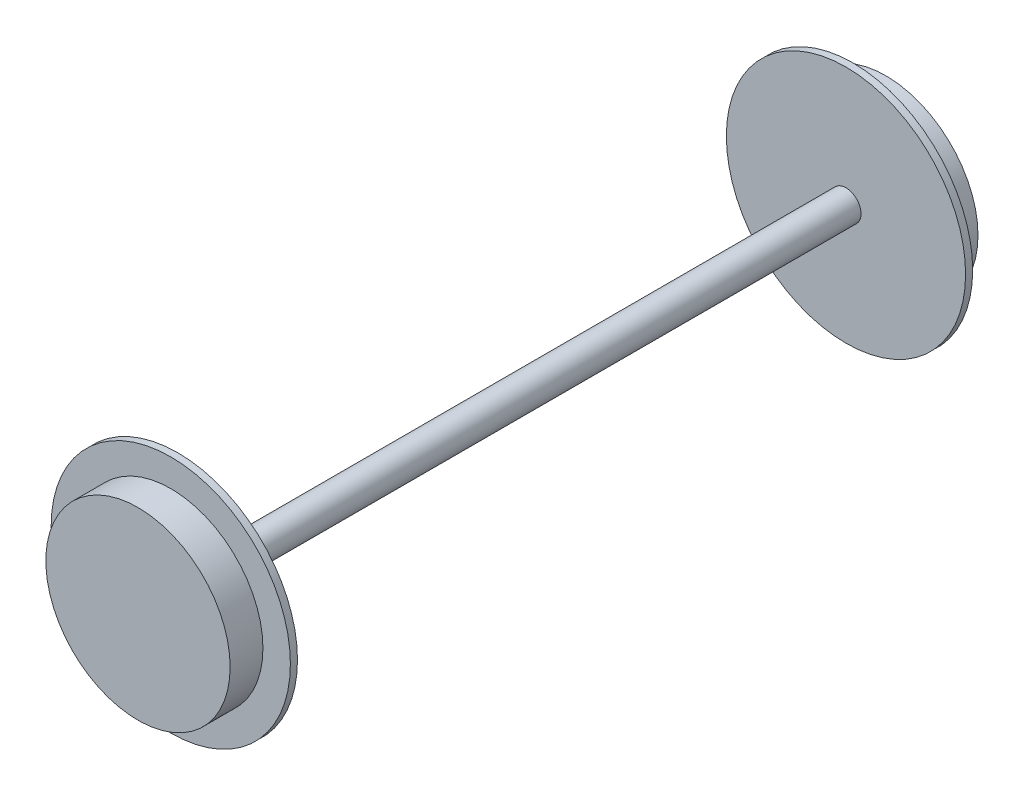
ISO-10303-21;
HEADER;
FILE_DESCRIPTION(('STEP AP214'),'2;1');
FILE_NAME('part.step','',(''),(''),'','','');
FILE_SCHEMA(('AUTOMOTIVE_DESIGN { 1 0 10303 214 1 1 1 1 }'));
ENDSEC;
DATA;
#1=APPLICATION_CONTEXT('core data for automotive mechanical design processes');
#2=APPLICATION_PROTOCOL_DEFINITION('international standard','automotive_design',2000,#1);
#3=PRODUCT_CONTEXT('',#1,'mechanical');
#4=PRODUCT('Part','Part','',(#3));
#5=PRODUCT_RELATED_PRODUCT_CATEGORY('part','',(#4));
#6=PRODUCT_DEFINITION_FORMATION('','',#4);
#7=PRODUCT_DEFINITION_CONTEXT('part definition',#1,'design');
#8=PRODUCT_DEFINITION('design','',#6,#7);
#9=PRODUCT_DEFINITION_SHAPE('','',#8);
#10=(LENGTH_UNIT() NAMED_UNIT(*) SI_UNIT(.MILLI.,.METRE.));
#11=(NAMED_UNIT(*) PLANE_ANGLE_UNIT() SI_UNIT($,.RADIAN.));
#12=(NAMED_UNIT(*) SI_UNIT($,.STERADIAN.) SOLID_ANGLE_UNIT());
#13=UNCERTAINTY_MEASURE_WITH_UNIT(LENGTH_MEASURE(1.E-05),#10,'distance_accuracy_value','');
#14=(GEOMETRIC_REPRESENTATION_CONTEXT(3) GLOBAL_UNCERTAINTY_ASSIGNED_CONTEXT((#13)) GLOBAL_UNIT_ASSIGNED_CONTEXT((#10,
#11,#12)) REPRESENTATION_CONTEXT('',''));
#15=CARTESIAN_POINT('',(0.,0.,0.));
#16=DIRECTION('',(0.,0.,1.));
#17=DIRECTION('',(1.,0.,0.));
#18=AXIS2_PLACEMENT_3D('',#15,#16,#17);
#19=CARTESIAN_POINT('',(0.,52.,-211.));
#20=DIRECTION('',(0.,0.,1.));
#21=DIRECTION('',(1.,0.,0.));
#22=AXIS2_PLACEMENT_3D('',#19,#20,#21);
#23=PLANE('',#22);
#24=CARTESIAN_POINT('',(0.,0.,-211.));
#25=DIRECTION('',(0.,0.,1.));
#26=DIRECTION('',(1.,0.,0.));
#27=AXIS2_PLACEMENT_3D('',#24,#25,#26);
#28=CIRCLE('',#27,52.);
#29=CARTESIAN_POINT('',(52.,0.,-211.));
#30=VERTEX_POINT('',#29);
#31=EDGE_CURVE('E10',#30,#30,#28,.T.);
#32=ORIENTED_EDGE('',*,*,#31,.F.);
#33=EDGE_LOOP('',(#32));
#34=FACE_BOUND('',#33,.T.);
#35=ADVANCED_FACE('F36',(#34),#23,.F.);
#36=CARTESIAN_POINT('',(0.,0.,0.));
#37=DIRECTION('',(0.,0.,1.));
#38=DIRECTION('',(1.,0.,0.));
#39=AXIS2_PLACEMENT_3D('',#36,#37,#38);
#40=CYLINDRICAL_SURFACE('',#39,52.);
#41=CARTESIAN_POINT('',(0.,0.,-192.5));
#42=DIRECTION('',(0.,0.,1.));
#43=DIRECTION('',(1.,0.,0.));
#44=AXIS2_PLACEMENT_3D('',#41,#42,#43);
#45=CIRCLE('',#44,52.);
#46=CARTESIAN_POINT('',(52.,0.,-192.5));
#47=VERTEX_POINT('',#46);
#48=EDGE_CURVE('E42',#47,#47,#45,.T.);
#49=ORIENTED_EDGE('',*,*,#48,.F.);
#50=EDGE_LOOP('',(#49));
#51=FACE_BOUND('',#50,.T.);
#52=ORIENTED_EDGE('',*,*,#31,.T.);
#53=EDGE_LOOP('',(#52));
#54=FACE_BOUND('',#53,.T.);
#55=ADVANCED_FACE('F94',(#51,#54),#40,.T.);
#56=CARTESIAN_POINT('',(0.,67.5,-192.5));
#57=DIRECTION('',(0.,0.,1.));
#58=DIRECTION('',(1.,0.,0.));
#59=AXIS2_PLACEMENT_3D('',#56,#57,#58);
#60=PLANE('',#59);
#61=CARTESIAN_POINT('',(0.,0.,-192.5));
#62=DIRECTION('',(0.,0.,1.));
#63=DIRECTION('',(1.,0.,0.));
#64=AXIS2_PLACEMENT_3D('',#61,#62,#63);
#65=CIRCLE('',#64,67.5);
#66=CARTESIAN_POINT('',(67.5,0.,-192.5));
#67=VERTEX_POINT('',#66);
#68=EDGE_CURVE('E46',#67,#67,#65,.T.);
#69=ORIENTED_EDGE('',*,*,#68,.F.);
#70=EDGE_LOOP('',(#69));
#71=FACE_BOUND('',#70,.T.);
#72=ORIENTED_EDGE('',*,*,#48,.T.);
#73=EDGE_LOOP('',(#72));
#74=FACE_BOUND('',#73,.T.);
#75=ADVANCED_FACE('F99',(#71,#74),#60,.F.);
#76=CARTESIAN_POINT('',(0.,0.,0.));
#77=DIRECTION('',(0.,0.,1.));
#78=DIRECTION('',(1.,0.,0.));
#79=AXIS2_PLACEMENT_3D('',#76,#77,#78);
#80=CYLINDRICAL_SURFACE('',#79,67.5);
#81=CARTESIAN_POINT('',(0.,0.,-188.5));
#82=DIRECTION('',(0.,0.,1.));
#83=DIRECTION('',(1.,0.,0.));
#84=AXIS2_PLACEMENT_3D('',#81,#82,#83);
#85=CIRCLE('',#84,67.5);
#86=CARTESIAN_POINT('',(67.5,0.,-188.5));
#87=VERTEX_POINT('',#86);
#88=EDGE_CURVE('E50',#87,#87,#85,.T.);
#89=ORIENTED_EDGE('',*,*,#88,.F.);
#90=EDGE_LOOP('',(#89));
#91=FACE_BOUND('',#90,.T.);
#92=ORIENTED_EDGE('',*,*,#68,.T.);
#93=EDGE_LOOP('',(#92));
#94=FACE_BOUND('',#93,.T.);
#95=ADVANCED_FACE('F90',(#91,#94),#80,.T.);
#96=CARTESIAN_POINT('',(0.,8.49999999999997,-188.5));
#97=DIRECTION('',(0.,0.,-1.));
#98=DIRECTION('',(-1.,0.,0.));
#99=AXIS2_PLACEMENT_3D('',#96,#97,#98);
#100=PLANE('',#99);
#101=CARTESIAN_POINT('',(0.,0.,-188.5));
#102=DIRECTION('',(0.,0.,1.));
#103=DIRECTION('',(1.,0.,0.));
#104=AXIS2_PLACEMENT_3D('',#101,#102,#103);
#105=CIRCLE('',#104,8.49999999999997);
#106=CARTESIAN_POINT('',(8.49999999999997,0.,-188.5));
#107=VERTEX_POINT('',#106);
#108=EDGE_CURVE('E55',#107,#107,#105,.T.);
#109=ORIENTED_EDGE('',*,*,#108,.F.);
#110=EDGE_LOOP('',(#109));
#111=FACE_BOUND('',#110,.T.);
#112=ORIENTED_EDGE('',*,*,#88,.T.);
#113=EDGE_LOOP('',(#112));
#114=FACE_BOUND('',#113,.T.);
#115=ADVANCED_FACE('F80',(#111,#114),#100,.F.);
#116=CARTESIAN_POINT('',(0.,0.,0.));
#117=DIRECTION('',(0.,0.,1.));
#118=DIRECTION('',(1.,0.,0.));
#119=AXIS2_PLACEMENT_3D('',#116,#117,#118);
#120=CYLINDRICAL_SURFACE('',#119,8.49999999999997);
#121=ORIENTED_EDGE('',*,*,#108,.T.);
#122=EDGE_LOOP('',(#121));
#123=FACE_BOUND('',#122,.T.);
#124=CARTESIAN_POINT('',(0.,0.,188.5));
#125=DIRECTION('',(0.,0.,1.));
#126=DIRECTION('',(1.,0.,0.));
#127=AXIS2_PLACEMENT_3D('',#124,#125,#126);
#128=CIRCLE('',#127,8.49999999999997);
#129=CARTESIAN_POINT('',(8.49999999999997,0.,188.5));
#130=VERTEX_POINT('',#129);
#131=EDGE_CURVE('E70',#130,#130,#128,.T.);
#132=ORIENTED_EDGE('',*,*,#131,.F.);
#133=EDGE_LOOP('',(#132));
#134=FACE_BOUND('',#133,.T.);
#135=ADVANCED_FACE('F77',(#123,#134),#120,.T.);
#136=CARTESIAN_POINT('',(0.,52.,211.));
#137=DIRECTION('',(0.,0.,-1.));
#138=DIRECTION('',(1.,0.,0.));
#139=AXIS2_PLACEMENT_3D('',#136,#137,#138);
#140=PLANE('',#139);
#141=CARTESIAN_POINT('',(0.,0.,211.));
#142=DIRECTION('',(0.,0.,1.));
#143=DIRECTION('',(1.,0.,0.));
#144=AXIS2_PLACEMENT_3D('',#141,#142,#143);
#145=CIRCLE('',#144,52.);
#146=CARTESIAN_POINT('',(52.,0.,211.));
#147=VERTEX_POINT('',#146);
#148=EDGE_CURVE('E58',#147,#147,#145,.T.);
#149=ORIENTED_EDGE('',*,*,#148,.T.);
#150=EDGE_LOOP('',(#149));
#151=FACE_BOUND('',#150,.T.);
#152=ADVANCED_FACE('F79',(#151),#140,.F.);
#153=CARTESIAN_POINT('',(0.,0.,0.));
#154=DIRECTION('',(0.,0.,-1.));
#155=DIRECTION('',(1.,0.,0.));
#156=AXIS2_PLACEMENT_3D('',#153,#154,#155);
#157=CYLINDRICAL_SURFACE('',#156,52.);
#158=CARTESIAN_POINT('',(0.,0.,192.5));
#159=DIRECTION('',(0.,0.,1.));
#160=DIRECTION('',(1.,0.,0.));
#161=AXIS2_PLACEMENT_3D('',#158,#159,#160);
#162=CIRCLE('',#161,52.);
#163=CARTESIAN_POINT('',(52.,0.,192.5));
#164=VERTEX_POINT('',#163);
#165=EDGE_CURVE('E61',#164,#164,#162,.T.);
#166=ORIENTED_EDGE('',*,*,#165,.T.);
#167=EDGE_LOOP('',(#166));
#168=FACE_BOUND('',#167,.T.);
#169=ORIENTED_EDGE('',*,*,#148,.F.);
#170=EDGE_LOOP('',(#169));
#171=FACE_BOUND('',#170,.T.);
#172=ADVANCED_FACE('F87',(#168,#171),#157,.T.);
#173=CARTESIAN_POINT('',(0.,67.5,192.5));
#174=DIRECTION('',(0.,0.,-1.));
#175=DIRECTION('',(1.,0.,0.));
#176=AXIS2_PLACEMENT_3D('',#173,#174,#175);
#177=PLANE('',#176);
#178=CARTESIAN_POINT('',(0.,0.,192.5));
#179=DIRECTION('',(0.,0.,1.));
#180=DIRECTION('',(1.,0.,0.));
#181=AXIS2_PLACEMENT_3D('',#178,#179,#180);
#182=CIRCLE('',#181,67.5);
#183=CARTESIAN_POINT('',(67.5,0.,192.5));
#184=VERTEX_POINT('',#183);
#185=EDGE_CURVE('E64',#184,#184,#182,.T.);
#186=ORIENTED_EDGE('',*,*,#185,.T.);
#187=EDGE_LOOP('',(#186));
#188=FACE_BOUND('',#187,.T.);
#189=ORIENTED_EDGE('',*,*,#165,.F.);
#190=EDGE_LOOP('',(#189));
#191=FACE_BOUND('',#190,.T.);
#192=ADVANCED_FACE('F143',(#188,#191),#177,.F.);
#193=CARTESIAN_POINT('',(0.,0.,0.));
#194=DIRECTION('',(0.,0.,-1.));
#195=DIRECTION('',(1.,0.,0.));
#196=AXIS2_PLACEMENT_3D('',#193,#194,#195);
#197=CYLINDRICAL_SURFACE('',#196,67.5);
#198=CARTESIAN_POINT('',(0.,0.,188.5));
#199=DIRECTION('',(0.,0.,1.));
#200=DIRECTION('',(1.,0.,0.));
#201=AXIS2_PLACEMENT_3D('',#198,#199,#200);
#202=CIRCLE('',#201,67.5);
#203=CARTESIAN_POINT('',(67.5,0.,188.5));
#204=VERTEX_POINT('',#203);
#205=EDGE_CURVE('E67',#204,#204,#202,.T.);
#206=ORIENTED_EDGE('',*,*,#205,.T.);
#207=EDGE_LOOP('',(#206));
#208=FACE_BOUND('',#207,.T.);
#209=ORIENTED_EDGE('',*,*,#185,.F.);
#210=EDGE_LOOP('',(#209));
#211=FACE_BOUND('',#210,.T.);
#212=ADVANCED_FACE('F154',(#208,#211),#197,.T.);
#213=CARTESIAN_POINT('',(0.,8.49999999999997,188.5));
#214=DIRECTION('',(0.,0.,1.));
#215=DIRECTION('',(-1.,0.,0.));
#216=AXIS2_PLACEMENT_3D('',#213,#214,#215);
#217=PLANE('',#216);
#218=ORIENTED_EDGE('',*,*,#131,.T.);
#219=EDGE_LOOP('',(#218));
#220=FACE_BOUND('',#219,.T.);
#221=ORIENTED_EDGE('',*,*,#205,.F.);
#222=EDGE_LOOP('',(#221));
#223=FACE_BOUND('',#222,.T.);
#224=ADVANCED_FACE('F74',(#220,#223),#217,.F.);
#225=CLOSED_SHELL('',(#35,#55,#75,#95,#115,#135,#152,#172,#192,#212,#224));
#226=MANIFOLD_SOLID_BREP('B2',#225);
#227=ADVANCED_BREP_SHAPE_REPRESENTATION('',(#18,#226),#14);
#228=SHAPE_DEFINITION_REPRESENTATION(#9,#227);
ENDSEC;
END-ISO-10303-21;
